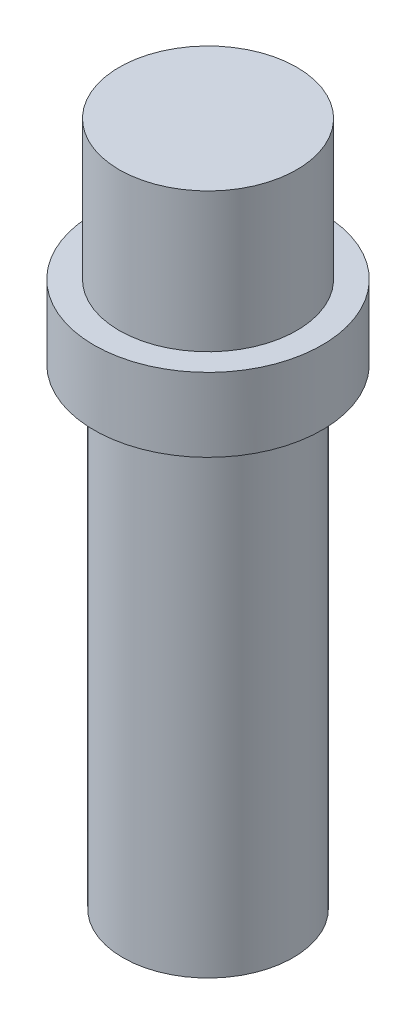
ISO-10303-21;
HEADER;
FILE_DESCRIPTION(('STEP AP214'),'2;1');
FILE_NAME('part.step','',(''),(''),'','','');
FILE_SCHEMA(('AUTOMOTIVE_DESIGN { 1 0 10303 214 1 1 1 1 }'));
ENDSEC;
DATA;
#1=APPLICATION_CONTEXT('core data for automotive mechanical design processes');
#2=APPLICATION_PROTOCOL_DEFINITION('international standard','automotive_design',2000,#1);
#3=PRODUCT_CONTEXT('',#1,'mechanical');
#4=PRODUCT('Part','Part','',(#3));
#5=PRODUCT_RELATED_PRODUCT_CATEGORY('part','',(#4));
#6=PRODUCT_DEFINITION_FORMATION('','',#4);
#7=PRODUCT_DEFINITION_CONTEXT('part definition',#1,'design');
#8=PRODUCT_DEFINITION('design','',#6,#7);
#9=PRODUCT_DEFINITION_SHAPE('','',#8);
#10=(LENGTH_UNIT() NAMED_UNIT(*) SI_UNIT(.MILLI.,.METRE.));
#11=(NAMED_UNIT(*) PLANE_ANGLE_UNIT() SI_UNIT($,.RADIAN.));
#12=(NAMED_UNIT(*) SI_UNIT($,.STERADIAN.) SOLID_ANGLE_UNIT());
#13=UNCERTAINTY_MEASURE_WITH_UNIT(LENGTH_MEASURE(1.E-05),#10,'distance_accuracy_value','');
#14=(GEOMETRIC_REPRESENTATION_CONTEXT(3) GLOBAL_UNCERTAINTY_ASSIGNED_CONTEXT((#13)) GLOBAL_UNIT_ASSIGNED_CONTEXT((#10,
#11,#12)) REPRESENTATION_CONTEXT('',''));
#15=CARTESIAN_POINT('',(0.,0.,0.));
#16=DIRECTION('',(0.,0.,1.));
#17=DIRECTION('',(1.,0.,0.));
#18=AXIS2_PLACEMENT_3D('',#15,#16,#17);
#19=CARTESIAN_POINT('',(0.,11.25,0.));
#20=DIRECTION('',(0.,-1.,0.));
#21=DIRECTION('',(0.,0.,-1.));
#22=AXIS2_PLACEMENT_3D('',#19,#20,#21);
#23=CYLINDRICAL_SURFACE('',#22,1.4);
#24=CARTESIAN_POINT('',(0.,0.,0.));
#25=DIRECTION('',(0.,1.,0.));
#26=DIRECTION('',(0.,0.,1.));
#27=AXIS2_PLACEMENT_3D('',#24,#25,#26);
#28=CIRCLE('',#27,1.4);
#29=CARTESIAN_POINT('',(0.,0.,1.4));
#30=VERTEX_POINT('',#29);
#31=EDGE_CURVE('E47',#30,#30,#28,.T.);
#32=ORIENTED_EDGE('',*,*,#31,.T.);
#33=EDGE_LOOP('',(#32));
#34=FACE_BOUND('',#33,.T.);
#35=CARTESIAN_POINT('',(0.,7.75,0.));
#36=DIRECTION('',(0.,1.,0.));
#37=DIRECTION('',(0.,0.,1.));
#38=AXIS2_PLACEMENT_3D('',#35,#36,#37);
#39=CIRCLE('',#38,1.4);
#40=CARTESIAN_POINT('',(0.,7.75,1.4));
#41=VERTEX_POINT('',#40);
#42=EDGE_CURVE('E43',#41,#41,#39,.T.);
#43=ORIENTED_EDGE('',*,*,#42,.F.);
#44=EDGE_LOOP('',(#43));
#45=FACE_BOUND('',#44,.T.);
#46=ADVANCED_FACE('F37',(#34,#45),#23,.T.);
#47=CARTESIAN_POINT('',(0.,0.,0.));
#48=DIRECTION('',(0.,1.,0.));
#49=DIRECTION('',(0.,0.,1.));
#50=AXIS2_PLACEMENT_3D('',#47,#48,#49);
#51=PLANE('',#50);
#52=ORIENTED_EDGE('',*,*,#31,.F.);
#53=EDGE_LOOP('',(#52));
#54=FACE_BOUND('',#53,.T.);
#55=ADVANCED_FACE('F78',(#54),#51,.F.);
#56=CARTESIAN_POINT('',(0.,7.75,0.));
#57=DIRECTION('',(0.,1.,0.));
#58=DIRECTION('',(0.,0.,1.));
#59=AXIS2_PLACEMENT_3D('',#56,#57,#58);
#60=PLANE('',#59);
#61=ORIENTED_EDGE('',*,*,#42,.T.);
#62=EDGE_LOOP('',(#61));
#63=FACE_BOUND('',#62,.T.);
#64=CARTESIAN_POINT('',(0.,7.75,0.));
#65=DIRECTION('',(0.,-1.,0.));
#66=DIRECTION('',(0.,0.,-1.));
#67=AXIS2_PLACEMENT_3D('',#64,#65,#66);
#68=CIRCLE('',#67,1.875);
#69=CARTESIAN_POINT('',(0.,7.75,-1.875));
#70=VERTEX_POINT('',#69);
#71=EDGE_CURVE('E59',#70,#70,#68,.T.);
#72=ORIENTED_EDGE('',*,*,#71,.T.);
#73=EDGE_LOOP('',(#72));
#74=FACE_BOUND('',#73,.T.);
#75=ADVANCED_FACE('F63',(#63,#74),#60,.F.);
#76=CARTESIAN_POINT('',(0.,8.96,0.));
#77=DIRECTION('',(0.,1.,0.));
#78=DIRECTION('',(0.,0.,1.));
#79=AXIS2_PLACEMENT_3D('',#76,#77,#78);
#80=PLANE('',#79);
#81=CARTESIAN_POINT('',(0.,8.96,0.));
#82=DIRECTION('',(0.,1.,0.));
#83=DIRECTION('',(0.,0.,1.));
#84=AXIS2_PLACEMENT_3D('',#81,#82,#83);
#85=CIRCLE('',#84,1.46);
#86=CARTESIAN_POINT('',(0.,8.96,1.46));
#87=VERTEX_POINT('',#86);
#88=EDGE_CURVE('E11',#87,#87,#85,.F.);
#89=ORIENTED_EDGE('',*,*,#88,.T.);
#90=EDGE_LOOP('',(#89));
#91=FACE_BOUND('',#90,.T.);
#92=CARTESIAN_POINT('',(0.,8.96,0.));
#93=DIRECTION('',(0.,1.,0.));
#94=DIRECTION('',(0.,0.,1.));
#95=AXIS2_PLACEMENT_3D('',#92,#93,#94);
#96=CIRCLE('',#95,1.875);
#97=CARTESIAN_POINT('',(0.,8.96,1.875));
#98=VERTEX_POINT('',#97);
#99=EDGE_CURVE('E56',#98,#98,#96,.F.);
#100=ORIENTED_EDGE('',*,*,#99,.F.);
#101=EDGE_LOOP('',(#100));
#102=FACE_BOUND('',#101,.T.);
#103=ADVANCED_FACE('F69',(#91,#102),#80,.T.);
#104=CARTESIAN_POINT('',(0.,16.5533008588991,0.));
#105=DIRECTION('',(0.,-1.,0.));
#106=DIRECTION('',(0.,0.,-1.));
#107=AXIS2_PLACEMENT_3D('',#104,#105,#106);
#108=CYLINDRICAL_SURFACE('',#107,1.875);
#109=ORIENTED_EDGE('',*,*,#71,.F.);
#110=EDGE_LOOP('',(#109));
#111=FACE_BOUND('',#110,.T.);
#112=ORIENTED_EDGE('',*,*,#99,.T.);
#113=EDGE_LOOP('',(#112));
#114=FACE_BOUND('',#113,.T.);
#115=ADVANCED_FACE('F65',(#111,#114),#108,.T.);
#116=CARTESIAN_POINT('',(0.,11.25,0.));
#117=DIRECTION('',(0.,1.,0.));
#118=DIRECTION('',(0.,0.,1.));
#119=AXIS2_PLACEMENT_3D('',#116,#117,#118);
#120=PLANE('',#119);
#121=CARTESIAN_POINT('',(0.,11.25,0.));
#122=DIRECTION('',(0.,1.,0.));
#123=DIRECTION('',(0.,0.,1.));
#124=AXIS2_PLACEMENT_3D('',#121,#122,#123);
#125=CIRCLE('',#124,1.46);
#126=CARTESIAN_POINT('',(0.,11.25,1.46));
#127=VERTEX_POINT('',#126);
#128=EDGE_CURVE('E51',#127,#127,#125,.T.);
#129=ORIENTED_EDGE('',*,*,#128,.T.);
#130=EDGE_LOOP('',(#129));
#131=FACE_BOUND('',#130,.T.);
#132=ADVANCED_FACE('F68',(#131),#120,.T.);
#133=CARTESIAN_POINT('',(0.,7.75,0.));
#134=DIRECTION('',(0.,1.,0.));
#135=DIRECTION('',(0.,0.,1.));
#136=AXIS2_PLACEMENT_3D('',#133,#134,#135);
#137=CYLINDRICAL_SURFACE('',#136,1.46);
#138=ORIENTED_EDGE('',*,*,#88,.F.);
#139=EDGE_LOOP('',(#138));
#140=FACE_BOUND('',#139,.T.);
#141=ORIENTED_EDGE('',*,*,#128,.F.);
#142=EDGE_LOOP('',(#141));
#143=FACE_BOUND('',#142,.T.);
#144=ADVANCED_FACE('F93',(#140,#143),#137,.T.);
#145=CLOSED_SHELL('',(#46,#55,#75,#103,#115,#132,#144));
#146=MANIFOLD_SOLID_BREP('B2',#145);
#147=ADVANCED_BREP_SHAPE_REPRESENTATION('',(#18,#146),#14);
#148=SHAPE_DEFINITION_REPRESENTATION(#9,#147);
ENDSEC;
END-ISO-10303-21;
